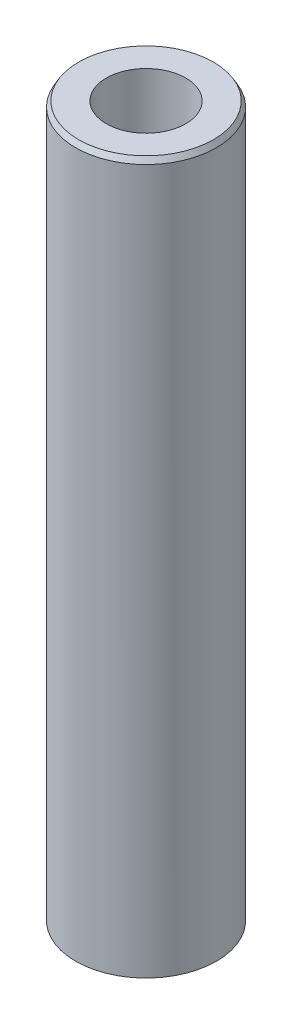
ISO-10303-21;
HEADER;
FILE_DESCRIPTION(('STEP AP214'),'2;1');
FILE_NAME('part.step','',(''),(''),'','','');
FILE_SCHEMA(('AUTOMOTIVE_DESIGN { 1 0 10303 214 1 1 1 1 }'));
ENDSEC;
DATA;
#1=APPLICATION_CONTEXT('core data for automotive mechanical design processes');
#2=APPLICATION_PROTOCOL_DEFINITION('international standard','automotive_design',2000,#1);
#3=PRODUCT_CONTEXT('',#1,'mechanical');
#4=PRODUCT('Part','Part','',(#3));
#5=PRODUCT_RELATED_PRODUCT_CATEGORY('part','',(#4));
#6=PRODUCT_DEFINITION_FORMATION('','',#4);
#7=PRODUCT_DEFINITION_CONTEXT('part definition',#1,'design');
#8=PRODUCT_DEFINITION('design','',#6,#7);
#9=PRODUCT_DEFINITION_SHAPE('','',#8);
#10=(LENGTH_UNIT() NAMED_UNIT(*) SI_UNIT(.MILLI.,.METRE.));
#11=(NAMED_UNIT(*) PLANE_ANGLE_UNIT() SI_UNIT($,.RADIAN.));
#12=(NAMED_UNIT(*) SI_UNIT($,.STERADIAN.) SOLID_ANGLE_UNIT());
#13=UNCERTAINTY_MEASURE_WITH_UNIT(LENGTH_MEASURE(1.E-05),#10,'distance_accuracy_value','');
#14=(GEOMETRIC_REPRESENTATION_CONTEXT(3) GLOBAL_UNCERTAINTY_ASSIGNED_CONTEXT((#13)) GLOBAL_UNIT_ASSIGNED_CONTEXT((#10,
#11,#12)) REPRESENTATION_CONTEXT('',''));
#15=CARTESIAN_POINT('',(0.,0.,0.));
#16=DIRECTION('',(0.,0.,1.));
#17=DIRECTION('',(1.,0.,0.));
#18=AXIS2_PLACEMENT_3D('',#15,#16,#17);
#19=CARTESIAN_POINT('',(0.,354.328485597664,0.));
#20=DIRECTION('',(0.,-1.,0.));
#21=DIRECTION('',(0.,0.,-1.));
#22=AXIS2_PLACEMENT_3D('',#19,#20,#21);
#23=CYLINDRICAL_SURFACE('',#22,35.);
#24=CARTESIAN_POINT('',(0.,351.65383429078,0.));
#25=DIRECTION('',(0.,1.,0.));
#26=DIRECTION('',(0.,0.,1.));
#27=AXIS2_PLACEMENT_3D('',#24,#25,#26);
#28=CIRCLE('',#27,35.);
#29=CARTESIAN_POINT('',(0.,351.65383429078,-35.));
#30=VERTEX_POINT('',#29);
#31=EDGE_CURVE('E50',#30,#30,#28,.F.);
#32=CARTESIAN_POINT('',(0.,1.54421065201826,0.));
#33=DIRECTION('',(0.,1.,0.));
#34=DIRECTION('',(0.,0.,1.));
#35=AXIS2_PLACEMENT_3D('',#32,#33,#34);
#36=CIRCLE('',#35,35.);
#37=CARTESIAN_POINT('',(0.,1.54421065201826,-35.));
#38=VERTEX_POINT('',#37);
#39=EDGE_CURVE('E51',#38,#38,#36,.T.);
#40=CARTESIAN_POINT('',(0.,351.65383429078,-35.));
#41=CARTESIAN_POINT('',(0.,348.006859044543,-35.));
#42=CARTESIAN_POINT('',(0.,344.359883798306,-35.));
#43=CARTESIAN_POINT('',(0.,337.065933305832,-35.));
#44=CARTESIAN_POINT('',(0.,333.418958059595,-35.));
#45=CARTESIAN_POINT('',(0.,326.125007567121,-35.));
#46=CARTESIAN_POINT('',(0.,322.478032320883,-35.));
#47=CARTESIAN_POINT('',(0.,315.184081828409,-35.));
#48=CARTESIAN_POINT('',(0.,311.537106582172,-35.));
#49=CARTESIAN_POINT('',(0.,304.243156089698,-35.));
#50=CARTESIAN_POINT('',(0.,300.596180843461,-35.));
#51=CARTESIAN_POINT('',(0.,293.302230350987,-35.));
#52=CARTESIAN_POINT('',(0.,289.65525510475,-35.));
#53=CARTESIAN_POINT('',(0.,282.361304612275,-35.));
#54=CARTESIAN_POINT('',(0.,278.714329366038,-35.));
#55=CARTESIAN_POINT('',(0.,271.420378873564,-35.));
#56=CARTESIAN_POINT('',(0.,267.773403627327,-35.));
#57=CARTESIAN_POINT('',(0.,260.479453134853,-35.));
#58=CARTESIAN_POINT('',(0.,256.832477888616,-35.));
#59=CARTESIAN_POINT('',(0.,249.538527396141,-35.));
#60=CARTESIAN_POINT('',(0.,245.891552149904,-35.));
#61=CARTESIAN_POINT('',(0.,238.59760165743,-35.));
#62=CARTESIAN_POINT('',(0.,234.950626411193,-35.));
#63=CARTESIAN_POINT('',(0.,227.656675918719,-35.));
#64=CARTESIAN_POINT('',(0.,224.009700672482,-35.));
#65=CARTESIAN_POINT('',(0.,216.715750180007,-35.));
#66=CARTESIAN_POINT('',(0.,213.06877493377,-35.));
#67=CARTESIAN_POINT('',(0.,205.774824441296,-35.));
#68=CARTESIAN_POINT('',(0.,202.127849195059,-35.));
#69=CARTESIAN_POINT('',(0.,194.833898702585,-35.));
#70=CARTESIAN_POINT('',(0.,191.186923456348,-35.));
#71=CARTESIAN_POINT('',(0.,183.892972963873,-35.));
#72=CARTESIAN_POINT('',(0.,180.245997717636,-35.));
#73=CARTESIAN_POINT('',(0.,172.952047225162,-35.));
#74=CARTESIAN_POINT('',(0.,169.305071978925,-35.));
#75=CARTESIAN_POINT('',(0.,162.011121486451,-35.));
#76=CARTESIAN_POINT('',(0.,158.364146240214,-35.));
#77=CARTESIAN_POINT('',(0.,151.07019574774,-35.));
#78=CARTESIAN_POINT('',(0.,147.423220501502,-35.));
#79=CARTESIAN_POINT('',(0.,140.129270009028,-35.));
#80=CARTESIAN_POINT('',(0.,136.482294762791,-35.));
#81=CARTESIAN_POINT('',(0.,129.188344270317,-35.));
#82=CARTESIAN_POINT('',(0.,125.54136902408,-35.));
#83=CARTESIAN_POINT('',(0.,118.247418531606,-35.));
#84=CARTESIAN_POINT('',(0.,114.600443285369,-35.));
#85=CARTESIAN_POINT('',(0.,107.306492792894,-35.));
#86=CARTESIAN_POINT('',(0.,103.659517546657,-35.));
#87=CARTESIAN_POINT('',(0.,96.365567054183,-35.));
#88=CARTESIAN_POINT('',(0.,92.7185918079459,-35.));
#89=CARTESIAN_POINT('',(0.,85.4246413154717,-35.));
#90=CARTESIAN_POINT('',(0.,81.7776660692346,-35.));
#91=CARTESIAN_POINT('',(0.,74.4837155767604,-35.));
#92=CARTESIAN_POINT('',(0.,70.8367403305232,-35.));
#93=CARTESIAN_POINT('',(0.,63.542789838049,-35.));
#94=CARTESIAN_POINT('',(0.,59.8958145918119,-35.));
#95=CARTESIAN_POINT('',(0.,52.6018640993377,-35.));
#96=CARTESIAN_POINT('',(0.,48.9548888531006,-35.));
#97=CARTESIAN_POINT('',(0.,41.6609383606264,-35.));
#98=CARTESIAN_POINT('',(0.,38.0139631143893,-35.));
#99=CARTESIAN_POINT('',(0.,30.7200126219151,-35.));
#100=CARTESIAN_POINT('',(0.,27.073037375678,-35.));
#101=CARTESIAN_POINT('',(0.,19.7790868832038,-35.));
#102=CARTESIAN_POINT('',(0.,16.1321116369667,-35.));
#103=CARTESIAN_POINT('',(0.,8.83816114449247,-35.));
#104=CARTESIAN_POINT('',(0.,5.19118589825537,-35.));
#105=CARTESIAN_POINT('',(0.,1.54421065201826,-35.));
#106=B_SPLINE_CURVE_WITH_KNOTS('',3,(#40,#41,#42,#43,#44,#45,#46,#47,#48,#49,#50,#51,#52,#53,
#54,#55,#56,#57,#58,#59,#60,#61,#62,#63,#64,#65,#66,#67,#68,#69,#70,#71,#72,#73,#74,#75,#76,#77,
#78,#79,#80,#81,#82,#83,#84,#85,#86,#87,#88,#89,#90,#91,#92,#93,#94,#95,#96,#97,#98,#99,#100,
#101,#102,#103,#104,#105),.UNSPECIFIED.,.F.,.F.,(4,2,2,2,2,2,2,2,2,2,2,2,2,2,2,2,2,2,2,2,2,2,2,
2,2,2,2,2,2,2,2,2,4),(0.,10.9409257387113,21.8818514774226,32.8227772161339,43.7637029548452,
54.7046286935565,65.6455544322678,76.5864801709792,87.5274059096905,98.4683316484018,
109.409257387113,120.350183125824,131.291108864536,142.232034603247,153.172960341958,
164.11388608067,175.054811819381,185.995737558092,196.936663296804,207.877589035515,
218.818514774226,229.759440512938,240.700366251649,251.64129199036,262.582217729071,
273.523143467783,284.464069206494,295.404994945205,306.345920683917,317.286846422628,
328.227772161339,339.168697900051,350.109623638762),.UNSPECIFIED.);
#107=EDGE_CURVE('BSEAM39',#30,#38,#106,.T.);
#108=ORIENTED_EDGE('',*,*,#31,.T.);
#109=ORIENTED_EDGE('',*,*,#39,.T.);
#110=ORIENTED_EDGE('',*,*,#107,.T.);
#111=ORIENTED_EDGE('',*,*,#107,.F.);
#112=EDGE_LOOP('',(#108,#110,#109,#111));
#113=FACE_BOUND('',#112,.T.);
#114=ADVANCED_FACE('F39',(#113),#23,.T.);
#115=CARTESIAN_POINT('',(0.,354.328485597664,0.));
#116=DIRECTION('',(0.,1.,0.));
#117=DIRECTION('',(0.,0.,1.));
#118=AXIS2_PLACEMENT_3D('',#115,#116,#117);
#119=PLANE('',#118);
#120=CARTESIAN_POINT('',(0.,354.328485597664,0.));
#121=DIRECTION('',(0.,1.,0.));
#122=DIRECTION('',(0.,0.,1.));
#123=AXIS2_PLACEMENT_3D('',#120,#121,#122);
#124=CIRCLE('',#123,33.4557893479821);
#125=CARTESIAN_POINT('',(0.,354.328485597664,33.4557893479821));
#126=VERTEX_POINT('',#125);
#127=EDGE_CURVE('E54',#126,#126,#124,.T.);
#128=ORIENTED_EDGE('',*,*,#127,.T.);
#129=EDGE_LOOP('',(#128));
#130=FACE_BOUND('',#129,.T.);
#131=CARTESIAN_POINT('',(0.,354.328485597664,0.));
#132=DIRECTION('',(0.,1.,0.));
#133=DIRECTION('',(0.,0.,1.));
#134=AXIS2_PLACEMENT_3D('',#131,#132,#133);
#135=CIRCLE('',#134,19.7233025460225);
#136=CARTESIAN_POINT('',(0.,354.328485597664,-19.7233025460225));
#137=VERTEX_POINT('',#136);
#138=EDGE_CURVE('E58',#137,#137,#135,.T.);
#139=ORIENTED_EDGE('',*,*,#138,.F.);
#140=EDGE_LOOP('',(#139));
#141=FACE_BOUND('',#140,.T.);
#142=ADVANCED_FACE('F69',(#130,#141),#119,.T.);
#143=CARTESIAN_POINT('',(0.,0.,0.));
#144=DIRECTION('',(0.,1.,0.));
#145=DIRECTION('',(0.,0.,1.));
#146=AXIS2_PLACEMENT_3D('',#143,#144,#145);
#147=PLANE('',#146);
#148=CARTESIAN_POINT('',(0.,0.,0.));
#149=DIRECTION('',(0.,1.,0.));
#150=DIRECTION('',(0.,0.,1.));
#151=AXIS2_PLACEMENT_3D('',#148,#149,#150);
#152=CIRCLE('',#151,32.3253486931153);
#153=CARTESIAN_POINT('',(0.,0.,32.3253486931153));
#154=VERTEX_POINT('',#153);
#155=EDGE_CURVE('E10',#154,#154,#152,.F.);
#156=ORIENTED_EDGE('',*,*,#155,.T.);
#157=EDGE_LOOP('',(#156));
#158=FACE_BOUND('',#157,.T.);
#159=CARTESIAN_POINT('',(0.,0.,0.));
#160=DIRECTION('',(0.,1.,0.));
#161=DIRECTION('',(0.,0.,1.));
#162=AXIS2_PLACEMENT_3D('',#159,#160,#161);
#163=CIRCLE('',#162,19.7233025460225);
#164=CARTESIAN_POINT('',(0.,0.,-19.7233025460225));
#165=VERTEX_POINT('',#164);
#166=EDGE_CURVE('E63',#165,#165,#163,.T.);
#167=ORIENTED_EDGE('',*,*,#166,.T.);
#168=EDGE_LOOP('',(#167));
#169=FACE_BOUND('',#168,.T.);
#170=ADVANCED_FACE('F75',(#158,#169),#147,.F.);
#171=CARTESIAN_POINT('',(0.,354.328485597664,0.));
#172=DIRECTION('',(0.,-1.,0.));
#173=DIRECTION('',(0.,0.,-1.));
#174=AXIS2_PLACEMENT_3D('',#171,#172,#173);
#175=CYLINDRICAL_SURFACE('',#174,19.7233025460225);
#176=CARTESIAN_POINT('',(0.,354.328485597664,-19.7233025460225));
#177=CARTESIAN_POINT('',(0.,350.637563872689,-19.7233025460225));
#178=CARTESIAN_POINT('',(0.,346.946642147713,-19.7233025460225));
#179=CARTESIAN_POINT('',(0.,339.564798697762,-19.7233025460225));
#180=CARTESIAN_POINT('',(0.,335.873876972786,-19.7233025460225));
#181=CARTESIAN_POINT('',(0.,328.492033522835,-19.7233025460225));
#182=CARTESIAN_POINT('',(0.,324.801111797859,-19.7233025460225));
#183=CARTESIAN_POINT('',(0.,317.419268347908,-19.7233025460225));
#184=CARTESIAN_POINT('',(0.,313.728346622932,-19.7233025460225));
#185=CARTESIAN_POINT('',(0.,306.346503172981,-19.7233025460225));
#186=CARTESIAN_POINT('',(0.,302.655581448005,-19.7233025460225));
#187=CARTESIAN_POINT('',(0.,295.273737998054,-19.7233025460225));
#188=CARTESIAN_POINT('',(0.,291.582816273078,-19.7233025460225));
#189=CARTESIAN_POINT('',(0.,284.200972823127,-19.7233025460225));
#190=CARTESIAN_POINT('',(0.,280.510051098151,-19.7233025460225));
#191=CARTESIAN_POINT('',(0.,273.1282076482,-19.7233025460225));
#192=CARTESIAN_POINT('',(0.,269.437285923224,-19.7233025460225));
#193=CARTESIAN_POINT('',(0.,262.055442473273,-19.7233025460225));
#194=CARTESIAN_POINT('',(0.,258.364520748297,-19.7233025460225));
#195=CARTESIAN_POINT('',(0.,250.982677298346,-19.7233025460225));
#196=CARTESIAN_POINT('',(0.,247.29175557337,-19.7233025460225));
#197=CARTESIAN_POINT('',(0.,239.909912123419,-19.7233025460225));
#198=CARTESIAN_POINT('',(0.,236.218990398443,-19.7233025460225));
#199=CARTESIAN_POINT('',(0.,228.837146948492,-19.7233025460225));
#200=CARTESIAN_POINT('',(0.,225.146225223516,-19.7233025460225));
#201=CARTESIAN_POINT('',(0.,217.764381773565,-19.7233025460225));
#202=CARTESIAN_POINT('',(0.,214.073460048589,-19.7233025460225));
#203=CARTESIAN_POINT('',(0.,206.691616598638,-19.7233025460225));
#204=CARTESIAN_POINT('',(0.,203.000694873662,-19.7233025460225));
#205=CARTESIAN_POINT('',(0.,195.618851423711,-19.7233025460225));
#206=CARTESIAN_POINT('',(0.,191.927929698735,-19.7233025460225));
#207=CARTESIAN_POINT('',(0.,184.546086248783,-19.7233025460225));
#208=CARTESIAN_POINT('',(0.,180.855164523808,-19.7233025460225));
#209=CARTESIAN_POINT('',(0.,173.473321073856,-19.7233025460225));
#210=CARTESIAN_POINT('',(0.,169.782399348881,-19.7233025460225));
#211=CARTESIAN_POINT('',(0.,162.400555898929,-19.7233025460225));
#212=CARTESIAN_POINT('',(0.,158.709634173954,-19.7233025460225));
#213=CARTESIAN_POINT('',(0.,151.327790724002,-19.7233025460225));
#214=CARTESIAN_POINT('',(0.,147.636868999027,-19.7233025460225));
#215=CARTESIAN_POINT('',(0.,140.255025549075,-19.7233025460225));
#216=CARTESIAN_POINT('',(0.,136.5641038241,-19.7233025460225));
#217=CARTESIAN_POINT('',(0.,129.182260374148,-19.7233025460225));
#218=CARTESIAN_POINT('',(0.,125.491338649173,-19.7233025460225));
#219=CARTESIAN_POINT('',(0.,118.109495199221,-19.7233025460225));
#220=CARTESIAN_POINT('',(0.,114.418573474246,-19.7233025460225));
#221=CARTESIAN_POINT('',(0.,107.036730024294,-19.7233025460225));
#222=CARTESIAN_POINT('',(0.,103.345808299319,-19.7233025460225));
#223=CARTESIAN_POINT('',(0.,95.9639648493674,-19.7233025460225));
#224=CARTESIAN_POINT('',(0.,92.2730431243917,-19.7233025460225));
#225=CARTESIAN_POINT('',(0.,84.8911996744404,-19.7233025460225));
#226=CARTESIAN_POINT('',(0.,81.2002779494647,-19.7233025460225));
#227=CARTESIAN_POINT('',(0.,73.8184344995134,-19.7233025460225));
#228=CARTESIAN_POINT('',(0.,70.1275127745377,-19.7233025460225));
#229=CARTESIAN_POINT('',(0.,62.7456693245864,-19.7233025460225));
#230=CARTESIAN_POINT('',(0.,59.0547475996107,-19.7233025460225));
#231=CARTESIAN_POINT('',(0.,51.6729041496594,-19.7233025460225));
#232=CARTESIAN_POINT('',(0.,47.9819824246837,-19.7233025460225));
#233=CARTESIAN_POINT('',(0.,40.6001389747324,-19.7233025460225));
#234=CARTESIAN_POINT('',(0.,36.9092172497567,-19.7233025460225));
#235=CARTESIAN_POINT('',(0.,29.5273737998053,-19.7233025460225));
#236=CARTESIAN_POINT('',(0.,25.8364520748297,-19.7233025460225));
#237=CARTESIAN_POINT('',(0.,18.4546086248783,-19.7233025460225));
#238=CARTESIAN_POINT('',(0.,14.7636868999027,-19.7233025460225));
#239=CARTESIAN_POINT('',(0.,7.38184344995133,-19.7233025460225));
#240=CARTESIAN_POINT('',(0.,3.69092172497567,-19.7233025460225));
#241=CARTESIAN_POINT('',(0.,0.,-19.7233025460225));
#242=B_SPLINE_CURVE_WITH_KNOTS('',3,(#176,#177,#178,#179,#180,#181,#182,#183,#184,#185,#186,
#187,#188,#189,#190,#191,#192,#193,#194,#195,#196,#197,#198,#199,#200,#201,#202,#203,#204,#205,
#206,#207,#208,#209,#210,#211,#212,#213,#214,#215,#216,#217,#218,#219,#220,#221,#222,#223,#224,
#225,#226,#227,#228,#229,#230,#231,#232,#233,#234,#235,#236,#237,#238,#239,#240,#241),
.UNSPECIFIED.,.F.,.F.,(4,2,2,2,2,2,2,2,2,2,2,2,2,2,2,2,2,2,2,2,2,2,2,2,2,2,2,2,2,2,2,2,4),(0.,
11.072765174927,22.145530349854,33.218295524781,44.291060699708,55.363825874635,66.436591049562,
77.509356224489,88.582121399416,99.6548865743431,110.72765174927,121.800416924197,
132.873182099124,143.945947274051,155.018712448978,166.091477623905,177.164242798832,
188.237007973759,199.309773148686,210.382538323613,221.45530349854,232.528068673467,
243.600833848394,254.673599023321,265.746364198248,276.819129373175,287.891894548102,
298.964659723029,310.037424897956,321.110190072883,332.18295524781,343.255720422737,
354.328485597664),.UNSPECIFIED.);
#243=EDGE_CURVE('BSEAM70',#137,#165,#242,.T.);
#244=ORIENTED_EDGE('',*,*,#138,.T.);
#245=ORIENTED_EDGE('',*,*,#166,.F.);
#246=ORIENTED_EDGE('',*,*,#243,.T.);
#247=ORIENTED_EDGE('',*,*,#243,.F.);
#248=EDGE_LOOP('',(#244,#246,#245,#247));
#249=FACE_BOUND('',#248,.T.);
#250=ADVANCED_FACE('F70',(#249),#175,.F.);
#251=CARTESIAN_POINT('',(0.,354.328485597664,0.));
#252=DIRECTION('',(0.,-1.,0.));
#253=DIRECTION('',(0.,0.,-1.));
#254=AXIS2_PLACEMENT_3D('',#251,#252,#253);
#255=CONICAL_SURFACE('',#254,33.4557893479821,0.5235987755983);
#256=ORIENTED_EDGE('',*,*,#31,.F.);
#257=EDGE_LOOP('',(#256));
#258=FACE_BOUND('',#257,.T.);
#259=ORIENTED_EDGE('',*,*,#127,.F.);
#260=EDGE_LOOP('',(#259));
#261=FACE_BOUND('',#260,.T.);
#262=ADVANCED_FACE('F81',(#258,#261),#255,.T.);
#263=CARTESIAN_POINT('',(0.,1.54421065201826,0.));
#264=DIRECTION('',(0.,1.,0.));
#265=DIRECTION('',(0.,0.,1.));
#266=AXIS2_PLACEMENT_3D('',#263,#264,#265);
#267=CONICAL_SURFACE('',#266,35.,1.0471975511966);
#268=ORIENTED_EDGE('',*,*,#155,.F.);
#269=EDGE_LOOP('',(#268));
#270=FACE_BOUND('',#269,.T.);
#271=ORIENTED_EDGE('',*,*,#39,.F.);
#272=EDGE_LOOP('',(#271));
#273=FACE_BOUND('',#272,.T.);
#274=ADVANCED_FACE('F45',(#270,#273),#267,.T.);
#275=CLOSED_SHELL('',(#114,#142,#170,#250,#262,#274));
#276=MANIFOLD_SOLID_BREP('B2',#275);
#277=ADVANCED_BREP_SHAPE_REPRESENTATION('',(#18,#276),#14);
#278=SHAPE_DEFINITION_REPRESENTATION(#9,#277);
ENDSEC;
END-ISO-10303-21;
